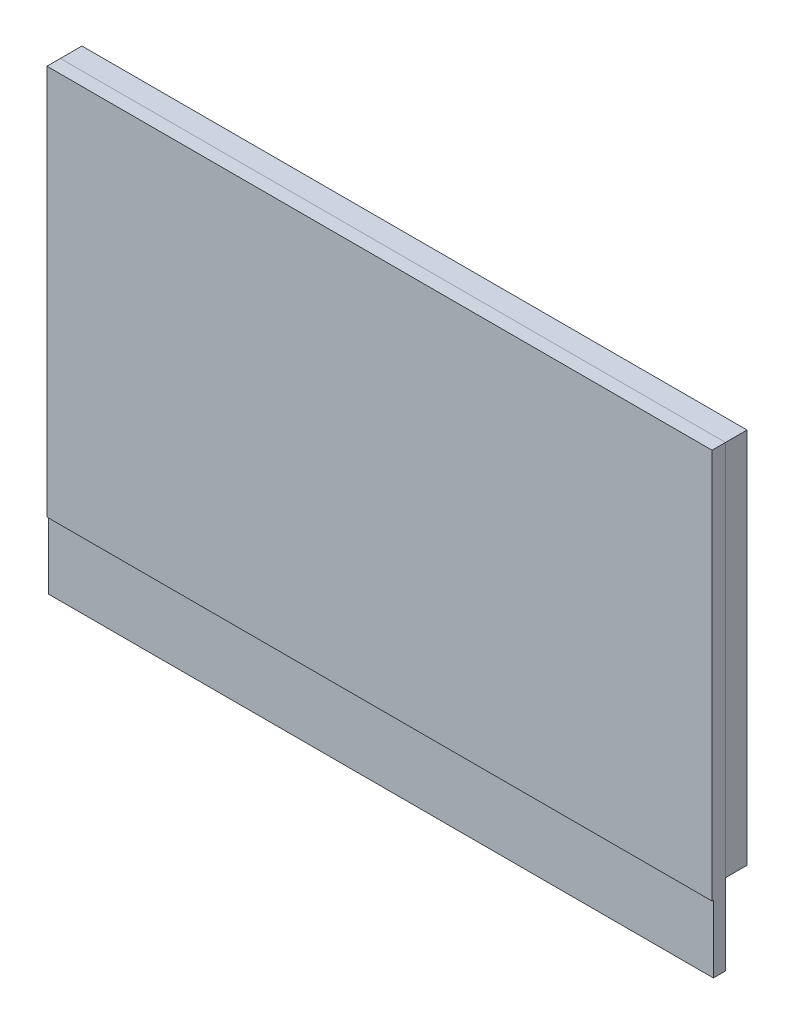
ISO-10303-21;
HEADER;
FILE_DESCRIPTION(('STEP AP214'),'2;1');
FILE_NAME('part.step','',(''),(''),'','','');
FILE_SCHEMA(('AUTOMOTIVE_DESIGN { 1 0 10303 214 1 1 1 1 }'));
ENDSEC;
DATA;
#1=APPLICATION_CONTEXT('core data for automotive mechanical design processes');
#2=APPLICATION_PROTOCOL_DEFINITION('international standard','automotive_design',2000,#1);
#3=PRODUCT_CONTEXT('',#1,'mechanical');
#4=PRODUCT('Part','Part','',(#3));
#5=PRODUCT_RELATED_PRODUCT_CATEGORY('part','',(#4));
#6=PRODUCT_DEFINITION_FORMATION('','',#4);
#7=PRODUCT_DEFINITION_CONTEXT('part definition',#1,'design');
#8=PRODUCT_DEFINITION('design','',#6,#7);
#9=PRODUCT_DEFINITION_SHAPE('','',#8);
#10=(LENGTH_UNIT() NAMED_UNIT(*) SI_UNIT(.MILLI.,.METRE.));
#11=(NAMED_UNIT(*) PLANE_ANGLE_UNIT() SI_UNIT($,.RADIAN.));
#12=(NAMED_UNIT(*) SI_UNIT($,.STERADIAN.) SOLID_ANGLE_UNIT());
#13=UNCERTAINTY_MEASURE_WITH_UNIT(LENGTH_MEASURE(1.E-05),#10,'distance_accuracy_value','');
#14=(GEOMETRIC_REPRESENTATION_CONTEXT(3) GLOBAL_UNCERTAINTY_ASSIGNED_CONTEXT((#13)) GLOBAL_UNIT_ASSIGNED_CONTEXT((#10,
#11,#12)) REPRESENTATION_CONTEXT('',''));
#15=CARTESIAN_POINT('',(0.,0.,0.));
#16=DIRECTION('',(0.,0.,1.));
#17=DIRECTION('',(1.,0.,0.));
#18=AXIS2_PLACEMENT_3D('',#15,#16,#17);
#19=CARTESIAN_POINT('',(0.,-2.1,1.5));
#20=DIRECTION('',(0.,0.,1.));
#21=DIRECTION('',(1.,0.,0.));
#22=AXIS2_PLACEMENT_3D('',#19,#20,#21);
#23=PLANE('',#22);
#24=DIRECTION('',(1.,0.,0.));
#25=VECTOR('',#24,1.);
#26=CARTESIAN_POINT('',(-10.,2.9,1.5));
#27=LINE('',#26,#25);
#28=CARTESIAN_POINT('',(-10.,2.9,1.5));
#29=VERTEX_POINT('',#28);
#30=CARTESIAN_POINT('',(10.,2.9,1.5));
#31=VERTEX_POINT('',#30);
#32=EDGE_CURVE('P0_E25',#29,#31,#27,.T.);
#33=ORIENTED_EDGE('',*,*,#32,.T.);
#34=DIRECTION('',(0.,-1.,0.));
#35=VECTOR('',#34,1.);
#36=CARTESIAN_POINT('',(10.,2.9,1.5));
#37=LINE('',#36,#35);
#38=CARTESIAN_POINT('',(10.,-7.1,1.5));
#39=VERTEX_POINT('',#38);
#40=EDGE_CURVE('P0_E86',#31,#39,#37,.T.);
#41=ORIENTED_EDGE('',*,*,#40,.T.);
#42=DIRECTION('',(-1.,0.,0.));
#43=VECTOR('',#42,1.);
#44=CARTESIAN_POINT('',(10.,-7.1,1.5));
#45=LINE('',#44,#43);
#46=CARTESIAN_POINT('',(-10.,-7.1,1.5));
#47=VERTEX_POINT('',#46);
#48=EDGE_CURVE('P0_E79',#39,#47,#45,.T.);
#49=ORIENTED_EDGE('',*,*,#48,.T.);
#50=DIRECTION('',(0.,1.,0.));
#51=VECTOR('',#50,1.);
#52=CARTESIAN_POINT('',(-10.,-7.1,1.5));
#53=LINE('',#52,#51);
#54=EDGE_CURVE('P0_E62',#47,#29,#53,.T.);
#55=ORIENTED_EDGE('',*,*,#54,.T.);
#56=EDGE_LOOP('',(#33,#41,#49,#55));
#57=FACE_BOUND('',#56,.T.);
#58=ADVANCED_FACE('P0_F17',(#57),#23,.F.);
#59=CARTESIAN_POINT('',(0.,-2.1,2.));
#60=DIRECTION('',(0.,0.,1.));
#61=DIRECTION('',(1.,0.,0.));
#62=AXIS2_PLACEMENT_3D('',#59,#60,#61);
#63=PLANE('',#62);
#64=DIRECTION('',(-1.,0.,0.));
#65=VECTOR('',#64,1.);
#66=CARTESIAN_POINT('',(-10.,2.9,2.));
#67=LINE('',#66,#65);
#68=CARTESIAN_POINT('',(10.,2.9,2.));
#69=VERTEX_POINT('',#68);
#70=CARTESIAN_POINT('',(-10.,2.9,2.));
#71=VERTEX_POINT('',#70);
#72=EDGE_CURVE('P0_E11',#69,#71,#67,.T.);
#73=ORIENTED_EDGE('',*,*,#72,.T.);
#74=DIRECTION('',(0.,-1.,0.));
#75=VECTOR('',#74,1.);
#76=CARTESIAN_POINT('',(-10.,-7.1,2.));
#77=LINE('',#76,#75);
#78=CARTESIAN_POINT('',(-10.,-7.1,2.));
#79=VERTEX_POINT('',#78);
#80=EDGE_CURVE('P0_E72',#71,#79,#77,.T.);
#81=ORIENTED_EDGE('',*,*,#80,.T.);
#82=DIRECTION('',(1.,0.,0.));
#83=VECTOR('',#82,1.);
#84=CARTESIAN_POINT('',(10.,-7.1,2.));
#85=LINE('',#84,#83);
#86=CARTESIAN_POINT('',(10.,-7.1,2.));
#87=VERTEX_POINT('',#86);
#88=EDGE_CURVE('P0_E81',#79,#87,#85,.T.);
#89=ORIENTED_EDGE('',*,*,#88,.T.);
#90=DIRECTION('',(0.,1.,0.));
#91=VECTOR('',#90,1.);
#92=CARTESIAN_POINT('',(10.,2.9,2.));
#93=LINE('',#92,#91);
#94=EDGE_CURVE('P0_E94',#87,#69,#93,.T.);
#95=ORIENTED_EDGE('',*,*,#94,.T.);
#96=EDGE_LOOP('',(#73,#81,#89,#95));
#97=FACE_BOUND('',#96,.T.);
#98=ADVANCED_FACE('P0_F119',(#97),#63,.T.);
#99=CARTESIAN_POINT('',(10.,2.9,1.5));
#100=DIRECTION('',(0.,1.,0.));
#101=DIRECTION('',(1.,0.,0.));
#102=AXIS2_PLACEMENT_3D('',#99,#100,#101);
#103=PLANE('',#102);
#104=ORIENTED_EDGE('',*,*,#32,.F.);
#105=DIRECTION('',(0.,0.,1.));
#106=VECTOR('',#105,1.);
#107=CARTESIAN_POINT('',(-10.,2.9,1.5));
#108=LINE('',#107,#106);
#109=EDGE_CURVE('P0_E68',#29,#71,#108,.T.);
#110=ORIENTED_EDGE('',*,*,#109,.T.);
#111=ORIENTED_EDGE('',*,*,#72,.F.);
#112=DIRECTION('',(0.,0.,1.));
#113=VECTOR('',#112,1.);
#114=CARTESIAN_POINT('',(10.,2.9,1.5));
#115=LINE('',#114,#113);
#116=EDGE_CURVE('P0_E106',#31,#69,#115,.T.);
#117=ORIENTED_EDGE('',*,*,#116,.F.);
#118=EDGE_LOOP('',(#104,#110,#111,#117));
#119=FACE_BOUND('',#118,.T.);
#120=ADVANCED_FACE('P0_F107',(#119),#103,.T.);
#121=CARTESIAN_POINT('',(-10.,2.9,1.5));
#122=DIRECTION('',(-1.,0.,0.));
#123=DIRECTION('',(0.,0.,1.));
#124=AXIS2_PLACEMENT_3D('',#121,#122,#123);
#125=PLANE('',#124);
#126=ORIENTED_EDGE('',*,*,#54,.F.);
#127=DIRECTION('',(0.,0.,1.));
#128=VECTOR('',#127,1.);
#129=CARTESIAN_POINT('',(-10.,-7.1,1.5));
#130=LINE('',#129,#128);
#131=EDGE_CURVE('P0_E66',#47,#79,#130,.T.);
#132=ORIENTED_EDGE('',*,*,#131,.T.);
#133=ORIENTED_EDGE('',*,*,#80,.F.);
#134=ORIENTED_EDGE('',*,*,#109,.F.);
#135=EDGE_LOOP('',(#126,#132,#133,#134));
#136=FACE_BOUND('',#135,.T.);
#137=ADVANCED_FACE('P0_F64',(#136),#125,.T.);
#138=CARTESIAN_POINT('',(-10.,-7.1,1.5));
#139=DIRECTION('',(0.,-1.,0.));
#140=DIRECTION('',(0.,0.,-1.));
#141=AXIS2_PLACEMENT_3D('',#138,#139,#140);
#142=PLANE('',#141);
#143=ORIENTED_EDGE('',*,*,#48,.F.);
#144=DIRECTION('',(0.,0.,1.));
#145=VECTOR('',#144,1.);
#146=CARTESIAN_POINT('',(10.,-7.1,1.5));
#147=LINE('',#146,#145);
#148=EDGE_CURVE('P0_E88',#39,#87,#147,.T.);
#149=ORIENTED_EDGE('',*,*,#148,.T.);
#150=ORIENTED_EDGE('',*,*,#88,.F.);
#151=ORIENTED_EDGE('',*,*,#131,.F.);
#152=EDGE_LOOP('',(#143,#149,#150,#151));
#153=FACE_BOUND('',#152,.T.);
#154=ADVANCED_FACE('P0_F76',(#153),#142,.T.);
#155=CARTESIAN_POINT('',(10.,-7.1,1.5));
#156=DIRECTION('',(1.,0.,0.));
#157=DIRECTION('',(0.,1.,0.));
#158=AXIS2_PLACEMENT_3D('',#155,#156,#157);
#159=PLANE('',#158);
#160=ORIENTED_EDGE('',*,*,#40,.F.);
#161=ORIENTED_EDGE('',*,*,#116,.T.);
#162=ORIENTED_EDGE('',*,*,#94,.F.);
#163=ORIENTED_EDGE('',*,*,#148,.F.);
#164=EDGE_LOOP('',(#160,#161,#162,#163));
#165=FACE_BOUND('',#164,.T.);
#166=ADVANCED_FACE('P0_F112',(#165),#159,.T.);
#167=CLOSED_SHELL('',(#58,#98,#120,#137,#154,#166));
#168=MANIFOLD_SOLID_BREP('P0_B1',#167);
#169=CARTESIAN_POINT('',(0.,1.6,2.));
#170=DIRECTION('',(0.,0.,1.));
#171=DIRECTION('',(1.,0.,0.));
#172=AXIS2_PLACEMENT_3D('',#169,#170,#171);
#173=PLANE('',#172);
#174=DIRECTION('',(1.,0.,0.));
#175=VECTOR('',#174,1.);
#176=CARTESIAN_POINT('',(-12.35,8.6,2.));
#177=LINE('',#176,#175);
#178=CARTESIAN_POINT('',(-12.35,8.6,2.));
#179=VERTEX_POINT('',#178);
#180=CARTESIAN_POINT('',(12.35,8.6,2.));
#181=VERTEX_POINT('',#180);
#182=EDGE_CURVE('P1_E25',#179,#181,#177,.T.);
#183=ORIENTED_EDGE('',*,*,#182,.T.);
#184=DIRECTION('',(0.,-1.,0.));
#185=VECTOR('',#184,1.);
#186=CARTESIAN_POINT('',(12.35,8.6,2.));
#187=LINE('',#186,#185);
#188=CARTESIAN_POINT('',(12.35,-5.4,2.));
#189=VERTEX_POINT('',#188);
#190=EDGE_CURVE('P1_E81',#181,#189,#187,.T.);
#191=ORIENTED_EDGE('',*,*,#190,.T.);
#192=DIRECTION('',(-1.,0.,0.));
#193=VECTOR('',#192,1.);
#194=CARTESIAN_POINT('',(12.35,-5.4,2.));
#195=LINE('',#194,#193);
#196=CARTESIAN_POINT('',(-12.35,-5.4,2.));
#197=VERTEX_POINT('',#196);
#198=EDGE_CURVE('P1_E107',#189,#197,#195,.T.);
#199=ORIENTED_EDGE('',*,*,#198,.T.);
#200=DIRECTION('',(0.,1.,0.));
#201=VECTOR('',#200,1.);
#202=CARTESIAN_POINT('',(-12.35,-5.4,2.));
#203=LINE('',#202,#201);
#204=EDGE_CURVE('P1_E58',#197,#179,#203,.T.);
#205=ORIENTED_EDGE('',*,*,#204,.T.);
#206=EDGE_LOOP('',(#183,#191,#199,#205));
#207=FACE_BOUND('',#206,.T.);
#208=ADVANCED_FACE('P1_F17',(#207),#173,.F.);
#209=CARTESIAN_POINT('',(0.,1.6,2.8));
#210=DIRECTION('',(0.,0.,1.));
#211=DIRECTION('',(1.,0.,0.));
#212=AXIS2_PLACEMENT_3D('',#209,#210,#211);
#213=PLANE('',#212);
#214=DIRECTION('',(-1.,0.,0.));
#215=VECTOR('',#214,1.);
#216=CARTESIAN_POINT('',(-12.35,8.6,2.8));
#217=LINE('',#216,#215);
#218=CARTESIAN_POINT('',(12.35,8.6,2.8));
#219=VERTEX_POINT('',#218);
#220=CARTESIAN_POINT('',(-12.35,8.6,2.8));
#221=VERTEX_POINT('',#220);
#222=EDGE_CURVE('P1_E11',#219,#221,#217,.T.);
#223=ORIENTED_EDGE('',*,*,#222,.T.);
#224=DIRECTION('',(0.,-1.,0.));
#225=VECTOR('',#224,1.);
#226=CARTESIAN_POINT('',(-12.35,-5.4,2.8));
#227=LINE('',#226,#225);
#228=CARTESIAN_POINT('',(-12.35,-5.4,2.8));
#229=VERTEX_POINT('',#228);
#230=EDGE_CURVE('P1_E114',#221,#229,#227,.T.);
#231=ORIENTED_EDGE('',*,*,#230,.T.);
#232=DIRECTION('',(1.,0.,0.));
#233=VECTOR('',#232,1.);
#234=CARTESIAN_POINT('',(12.35,-5.4,2.8));
#235=LINE('',#234,#233);
#236=CARTESIAN_POINT('',(12.35,-5.4,2.8));
#237=VERTEX_POINT('',#236);
#238=EDGE_CURVE('P1_E65',#229,#237,#235,.T.);
#239=ORIENTED_EDGE('',*,*,#238,.T.);
#240=DIRECTION('',(0.,1.,0.));
#241=VECTOR('',#240,1.);
#242=CARTESIAN_POINT('',(12.35,8.6,2.8));
#243=LINE('',#242,#241);
#244=EDGE_CURVE('P1_E91',#237,#219,#243,.T.);
#245=ORIENTED_EDGE('',*,*,#244,.T.);
#246=EDGE_LOOP('',(#223,#231,#239,#245));
#247=FACE_BOUND('',#246,.T.);
#248=ADVANCED_FACE('P1_F120',(#247),#213,.T.);
#249=CARTESIAN_POINT('',(12.35,8.6,2.));
#250=DIRECTION('',(0.,1.,0.));
#251=DIRECTION('',(1.,0.,0.));
#252=AXIS2_PLACEMENT_3D('',#249,#250,#251);
#253=PLANE('',#252);
#254=ORIENTED_EDGE('',*,*,#182,.F.);
#255=DIRECTION('',(0.,0.,1.));
#256=VECTOR('',#255,1.);
#257=CARTESIAN_POINT('',(-12.35,8.6,2.));
#258=LINE('',#257,#256);
#259=EDGE_CURVE('P1_E83',#179,#221,#258,.T.);
#260=ORIENTED_EDGE('',*,*,#259,.T.);
#261=ORIENTED_EDGE('',*,*,#222,.F.);
#262=DIRECTION('',(0.,0.,1.));
#263=VECTOR('',#262,1.);
#264=CARTESIAN_POINT('',(12.35,8.6,2.));
#265=LINE('',#264,#263);
#266=EDGE_CURVE('P1_E86',#181,#219,#265,.T.);
#267=ORIENTED_EDGE('',*,*,#266,.F.);
#268=EDGE_LOOP('',(#254,#260,#261,#267));
#269=FACE_BOUND('',#268,.T.);
#270=ADVANCED_FACE('P1_F87',(#269),#253,.T.);
#271=CARTESIAN_POINT('',(-12.35,8.6,2.));
#272=DIRECTION('',(-1.,0.,0.));
#273=DIRECTION('',(0.,0.,1.));
#274=AXIS2_PLACEMENT_3D('',#271,#272,#273);
#275=PLANE('',#274);
#276=ORIENTED_EDGE('',*,*,#204,.F.);
#277=DIRECTION('',(0.,0.,1.));
#278=VECTOR('',#277,1.);
#279=CARTESIAN_POINT('',(-12.35,-5.4,2.));
#280=LINE('',#279,#278);
#281=EDGE_CURVE('P1_E106',#197,#229,#280,.T.);
#282=ORIENTED_EDGE('',*,*,#281,.T.);
#283=ORIENTED_EDGE('',*,*,#230,.F.);
#284=ORIENTED_EDGE('',*,*,#259,.F.);
#285=EDGE_LOOP('',(#276,#282,#283,#284));
#286=FACE_BOUND('',#285,.T.);
#287=ADVANCED_FACE('P1_F119',(#286),#275,.T.);
#288=CARTESIAN_POINT('',(-12.35,-5.4,2.));
#289=DIRECTION('',(0.,-1.,0.));
#290=DIRECTION('',(0.,0.,-1.));
#291=AXIS2_PLACEMENT_3D('',#288,#289,#290);
#292=PLANE('',#291);
#293=ORIENTED_EDGE('',*,*,#198,.F.);
#294=DIRECTION('',(0.,0.,1.));
#295=VECTOR('',#294,1.);
#296=CARTESIAN_POINT('',(12.35,-5.4,2.));
#297=LINE('',#296,#295);
#298=EDGE_CURVE('P1_E95',#189,#237,#297,.T.);
#299=ORIENTED_EDGE('',*,*,#298,.T.);
#300=ORIENTED_EDGE('',*,*,#238,.F.);
#301=ORIENTED_EDGE('',*,*,#281,.F.);
#302=EDGE_LOOP('',(#293,#299,#300,#301));
#303=FACE_BOUND('',#302,.T.);
#304=ADVANCED_FACE('P1_F132',(#303),#292,.T.);
#305=CARTESIAN_POINT('',(12.35,-5.4,2.));
#306=DIRECTION('',(1.,0.,0.));
#307=DIRECTION('',(0.,1.,0.));
#308=AXIS2_PLACEMENT_3D('',#305,#306,#307);
#309=PLANE('',#308);
#310=ORIENTED_EDGE('',*,*,#190,.F.);
#311=ORIENTED_EDGE('',*,*,#266,.T.);
#312=ORIENTED_EDGE('',*,*,#244,.F.);
#313=ORIENTED_EDGE('',*,*,#298,.F.);
#314=EDGE_LOOP('',(#310,#311,#312,#313));
#315=FACE_BOUND('',#314,.T.);
#316=ADVANCED_FACE('P1_F94',(#315),#309,.T.);
#317=CLOSED_SHELL('',(#208,#248,#270,#287,#304,#316));
#318=MANIFOLD_SOLID_BREP('P1_B1',#317);
#319=CARTESIAN_POINT('',(0.,0.1,2.8));
#320=DIRECTION('',(0.,0.,1.));
#321=DIRECTION('',(1.,0.,0.));
#322=AXIS2_PLACEMENT_3D('',#319,#320,#321);
#323=PLANE('',#322);
#324=DIRECTION('',(-1.,0.,0.));
#325=VECTOR('',#324,1.);
#326=CARTESIAN_POINT('',(12.35,-8.4,2.8));
#327=LINE('',#326,#325);
#328=CARTESIAN_POINT('',(12.35,-8.4,2.8));
#329=VERTEX_POINT('',#328);
#330=CARTESIAN_POINT('',(-12.35,-8.4,2.8));
#331=VERTEX_POINT('',#330);
#332=EDGE_CURVE('P2_E11',#329,#331,#327,.T.);
#333=ORIENTED_EDGE('',*,*,#332,.T.);
#334=DIRECTION('',(0.,1.,0.));
#335=VECTOR('',#334,1.);
#336=CARTESIAN_POINT('',(-12.35,-8.4,2.8));
#337=LINE('',#336,#335);
#338=CARTESIAN_POINT('',(-12.35,8.6,2.8));
#339=VERTEX_POINT('',#338);
#340=EDGE_CURVE('P2_E99',#331,#339,#337,.T.);
#341=ORIENTED_EDGE('',*,*,#340,.T.);
#342=DIRECTION('',(1.,0.,0.));
#343=VECTOR('',#342,1.);
#344=CARTESIAN_POINT('',(-12.35,8.6,2.8));
#345=LINE('',#344,#343);
#346=CARTESIAN_POINT('',(12.35,8.6,2.8));
#347=VERTEX_POINT('',#346);
#348=EDGE_CURVE('P2_E86',#339,#347,#345,.T.);
#349=ORIENTED_EDGE('',*,*,#348,.T.);
#350=DIRECTION('',(0.,-1.,0.));
#351=VECTOR('',#350,1.);
#352=CARTESIAN_POINT('',(12.35,8.6,2.8));
#353=LINE('',#352,#351);
#354=EDGE_CURVE('P2_E26',#347,#329,#353,.T.);
#355=ORIENTED_EDGE('',*,*,#354,.T.);
#356=EDGE_LOOP('',(#333,#341,#349,#355));
#357=FACE_BOUND('',#356,.T.);
#358=ADVANCED_FACE('P2_F17',(#357),#323,.F.);
#359=CARTESIAN_POINT('',(-12.35,-8.4,2.8));
#360=DIRECTION('',(0.,-1.,0.));
#361=DIRECTION('',(0.,0.,-1.));
#362=AXIS2_PLACEMENT_3D('',#359,#360,#361);
#363=PLANE('',#362);
#364=DIRECTION('',(-1.,0.,0.));
#365=VECTOR('',#364,1.);
#366=CARTESIAN_POINT('',(-12.35,-8.4,3.25));
#367=LINE('',#366,#365);
#368=CARTESIAN_POINT('',(12.35,-8.4,3.25));
#369=VERTEX_POINT('',#368);
#370=CARTESIAN_POINT('',(-12.35,-8.4,3.25));
#371=VERTEX_POINT('',#370);
#372=EDGE_CURVE('P2_E112',#369,#371,#367,.T.);
#373=ORIENTED_EDGE('',*,*,#372,.T.);
#374=DIRECTION('',(0.,0.,1.));
#375=VECTOR('',#374,1.);
#376=CARTESIAN_POINT('',(-12.35,-8.4,2.8));
#377=LINE('',#376,#375);
#378=EDGE_CURVE('P2_E102',#331,#371,#377,.T.);
#379=ORIENTED_EDGE('',*,*,#378,.F.);
#380=ORIENTED_EDGE('',*,*,#332,.F.);
#381=DIRECTION('',(0.,0.,1.));
#382=VECTOR('',#381,1.);
#383=CARTESIAN_POINT('',(12.35,-8.4,2.8));
#384=LINE('',#383,#382);
#385=EDGE_CURVE('P2_E124',#329,#369,#384,.T.);
#386=ORIENTED_EDGE('',*,*,#385,.T.);
#387=EDGE_LOOP('',(#373,#379,#380,#386));
#388=FACE_BOUND('',#387,.T.);
#389=ADVANCED_FACE('P2_F19',(#388),#363,.T.);
#390=CARTESIAN_POINT('',(12.35,-8.4,2.8));
#391=DIRECTION('',(1.,0.,0.));
#392=DIRECTION('',(0.,1.,0.));
#393=AXIS2_PLACEMENT_3D('',#390,#391,#392);
#394=PLANE('',#393);
#395=DIRECTION('',(0.,-1.,0.));
#396=VECTOR('',#395,1.);
#397=CARTESIAN_POINT('',(12.35,-8.4,3.25));
#398=LINE('',#397,#396);
#399=CARTESIAN_POINT('',(12.35,-5.9,3.25));
#400=VERTEX_POINT('',#399);
#401=EDGE_CURVE('P2_E132',#400,#369,#398,.T.);
#402=ORIENTED_EDGE('',*,*,#401,.T.);
#403=ORIENTED_EDGE('',*,*,#385,.F.);
#404=ORIENTED_EDGE('',*,*,#354,.F.);
#405=DIRECTION('',(0.,0.,1.));
#406=VECTOR('',#405,1.);
#407=CARTESIAN_POINT('',(12.35,8.6,2.8));
#408=LINE('',#407,#406);
#409=CARTESIAN_POINT('',(12.35,8.6,3.3));
#410=VERTEX_POINT('',#409);
#411=EDGE_CURVE('P2_E93',#347,#410,#408,.T.);
#412=ORIENTED_EDGE('',*,*,#411,.T.);
#413=DIRECTION('',(0.,1.,0.));
#414=VECTOR('',#413,1.);
#415=CARTESIAN_POINT('',(12.35,8.6,3.3));
#416=LINE('',#415,#414);
#417=CARTESIAN_POINT('',(12.35,-5.9,3.3));
#418=VERTEX_POINT('',#417);
#419=EDGE_CURVE('P2_E116',#418,#410,#416,.T.);
#420=ORIENTED_EDGE('',*,*,#419,.F.);
#421=DIRECTION('',(0.,0.,-1.));
#422=VECTOR('',#421,1.);
#423=CARTESIAN_POINT('',(12.35,-5.9,3.025));
#424=LINE('',#423,#422);
#425=EDGE_CURVE('P2_E155',#418,#400,#424,.T.);
#426=ORIENTED_EDGE('',*,*,#425,.T.);
#427=EDGE_LOOP('',(#402,#403,#404,#412,#420,#426));
#428=FACE_BOUND('',#427,.T.);
#429=ADVANCED_FACE('P2_F130',(#428),#394,.T.);
#430=CARTESIAN_POINT('',(12.35,8.6,2.8));
#431=DIRECTION('',(0.,1.,0.));
#432=DIRECTION('',(1.,0.,0.));
#433=AXIS2_PLACEMENT_3D('',#430,#431,#432);
#434=PLANE('',#433);
#435=ORIENTED_EDGE('',*,*,#348,.F.);
#436=DIRECTION('',(0.,0.,1.));
#437=VECTOR('',#436,1.);
#438=CARTESIAN_POINT('',(-12.35,8.6,2.8));
#439=LINE('',#438,#437);
#440=CARTESIAN_POINT('',(-12.35,8.6,3.3));
#441=VERTEX_POINT('',#440);
#442=EDGE_CURVE('P2_E91',#339,#441,#439,.T.);
#443=ORIENTED_EDGE('',*,*,#442,.T.);
#444=DIRECTION('',(-1.,0.,0.));
#445=VECTOR('',#444,1.);
#446=CARTESIAN_POINT('',(-12.35,8.6,3.3));
#447=LINE('',#446,#445);
#448=EDGE_CURVE('P2_E96',#410,#441,#447,.T.);
#449=ORIENTED_EDGE('',*,*,#448,.F.);
#450=ORIENTED_EDGE('',*,*,#411,.F.);
#451=EDGE_LOOP('',(#435,#443,#449,#450));
#452=FACE_BOUND('',#451,.T.);
#453=ADVANCED_FACE('P2_F88',(#452),#434,.T.);
#454=CARTESIAN_POINT('',(0.,0.1,3.3));
#455=DIRECTION('',(0.,0.,1.));
#456=DIRECTION('',(1.,0.,0.));
#457=AXIS2_PLACEMENT_3D('',#454,#455,#456);
#458=PLANE('',#457);
#459=DIRECTION('',(1.,0.,0.));
#460=VECTOR('',#459,1.);
#461=CARTESIAN_POINT('',(-6.175,-5.9,3.3));
#462=LINE('',#461,#460);
#463=CARTESIAN_POINT('',(-12.35,-5.9,3.3));
#464=VERTEX_POINT('',#463);
#465=EDGE_CURVE('P2_E152',#464,#418,#462,.T.);
#466=ORIENTED_EDGE('',*,*,#465,.T.);
#467=ORIENTED_EDGE('',*,*,#419,.T.);
#468=ORIENTED_EDGE('',*,*,#448,.T.);
#469=DIRECTION('',(0.,-1.,0.));
#470=VECTOR('',#469,1.);
#471=CARTESIAN_POINT('',(-12.35,-8.4,3.3));
#472=LINE('',#471,#470);
#473=EDGE_CURVE('P2_E106',#441,#464,#472,.T.);
#474=ORIENTED_EDGE('',*,*,#473,.T.);
#475=EDGE_LOOP('',(#466,#467,#468,#474));
#476=FACE_BOUND('',#475,.T.);
#477=ADVANCED_FACE('P2_F167',(#476),#458,.T.);
#478=CARTESIAN_POINT('',(-12.35,8.6,2.8));
#479=DIRECTION('',(-1.,0.,0.));
#480=DIRECTION('',(0.,0.,1.));
#481=AXIS2_PLACEMENT_3D('',#478,#479,#480);
#482=PLANE('',#481);
#483=DIRECTION('',(0.,1.,0.));
#484=VECTOR('',#483,1.);
#485=CARTESIAN_POINT('',(-12.35,0.1,3.25));
#486=LINE('',#485,#484);
#487=CARTESIAN_POINT('',(-12.35,-5.9,3.25));
#488=VERTEX_POINT('',#487);
#489=EDGE_CURVE('P2_E140',#371,#488,#486,.T.);
#490=ORIENTED_EDGE('',*,*,#489,.T.);
#491=DIRECTION('',(0.,0.,1.));
#492=VECTOR('',#491,1.);
#493=CARTESIAN_POINT('',(-12.35,-5.9,3.025));
#494=LINE('',#493,#492);
#495=EDGE_CURVE('P2_E151',#488,#464,#494,.T.);
#496=ORIENTED_EDGE('',*,*,#495,.T.);
#497=ORIENTED_EDGE('',*,*,#473,.F.);
#498=ORIENTED_EDGE('',*,*,#442,.F.);
#499=ORIENTED_EDGE('',*,*,#340,.F.);
#500=ORIENTED_EDGE('',*,*,#378,.T.);
#501=EDGE_LOOP('',(#490,#496,#497,#498,#499,#500));
#502=FACE_BOUND('',#501,.T.);
#503=ADVANCED_FACE('P2_F104',(#502),#482,.T.);
#504=CARTESIAN_POINT('',(-12.35,-8.4,3.25));
#505=DIRECTION('',(0.,0.,-1.));
#506=DIRECTION('',(0.,-1.,0.));
#507=AXIS2_PLACEMENT_3D('',#504,#505,#506);
#508=PLANE('',#507);
#509=ORIENTED_EDGE('',*,*,#401,.F.);
#510=DIRECTION('',(1.,0.,0.));
#511=VECTOR('',#510,1.);
#512=CARTESIAN_POINT('',(-12.35,-5.9,3.25));
#513=LINE('',#512,#511);
#514=EDGE_CURVE('P2_E148',#488,#400,#513,.T.);
#515=ORIENTED_EDGE('',*,*,#514,.F.);
#516=ORIENTED_EDGE('',*,*,#489,.F.);
#517=ORIENTED_EDGE('',*,*,#372,.F.);
#518=EDGE_LOOP('',(#509,#515,#516,#517));
#519=FACE_BOUND('',#518,.T.);
#520=ADVANCED_FACE('P2_F137',(#519),#508,.F.);
#521=CARTESIAN_POINT('',(-12.35,-5.9,3.25));
#522=DIRECTION('',(0.,1.,0.));
#523=DIRECTION('',(1.,0.,0.));
#524=AXIS2_PLACEMENT_3D('',#521,#522,#523);
#525=PLANE('',#524);
#526=ORIENTED_EDGE('',*,*,#425,.F.);
#527=ORIENTED_EDGE('',*,*,#465,.F.);
#528=ORIENTED_EDGE('',*,*,#495,.F.);
#529=ORIENTED_EDGE('',*,*,#514,.T.);
#530=EDGE_LOOP('',(#526,#527,#528,#529));
#531=FACE_BOUND('',#530,.T.);
#532=ADVANCED_FACE('P2_F165',(#531),#525,.F.);
#533=CLOSED_SHELL('',(#358,#389,#429,#453,#477,#503,#520,#532));
#534=MANIFOLD_SOLID_BREP('P2_B1',#533);
#535=ADVANCED_BREP_SHAPE_REPRESENTATION('',(#18,#168,#318,#534),#14);
#536=SHAPE_DEFINITION_REPRESENTATION(#9,#535);
ENDSEC;
END-ISO-10303-21;
